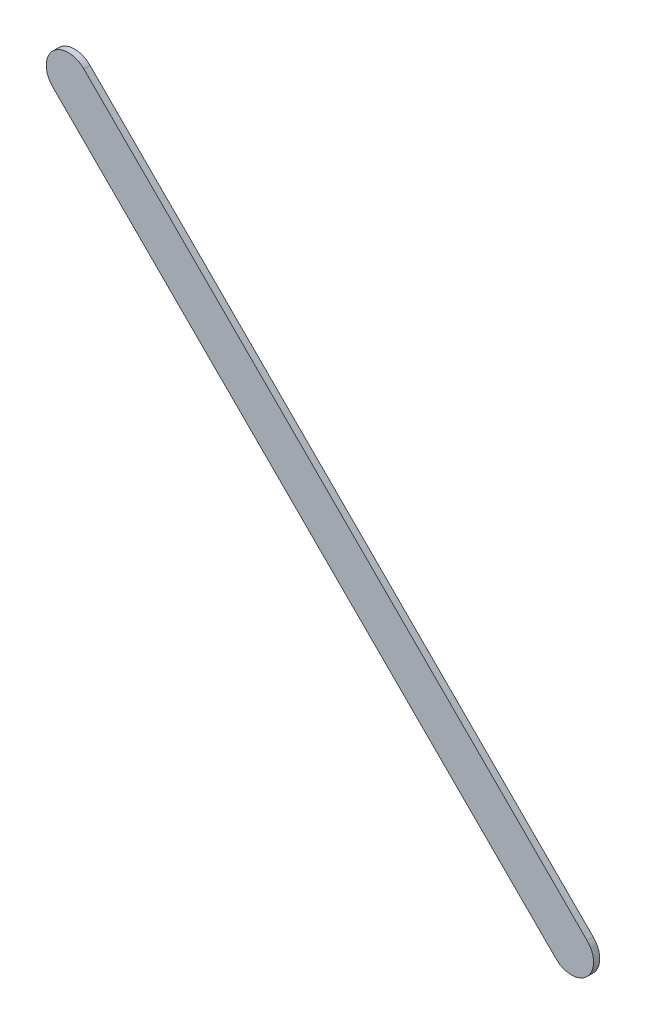
ISO-10303-21;
HEADER;
FILE_DESCRIPTION(('STEP AP214'),'2;1');
FILE_NAME('part.step','',(''),(''),'','','');
FILE_SCHEMA(('AUTOMOTIVE_DESIGN { 1 0 10303 214 1 1 1 1 }'));
ENDSEC;
DATA;
#1=APPLICATION_CONTEXT('core data for automotive mechanical design processes');
#2=APPLICATION_PROTOCOL_DEFINITION('international standard','automotive_design',2000,#1);
#3=PRODUCT_CONTEXT('',#1,'mechanical');
#4=PRODUCT('Part','Part','',(#3));
#5=PRODUCT_RELATED_PRODUCT_CATEGORY('part','',(#4));
#6=PRODUCT_DEFINITION_FORMATION('','',#4);
#7=PRODUCT_DEFINITION_CONTEXT('part definition',#1,'design');
#8=PRODUCT_DEFINITION('design','',#6,#7);
#9=PRODUCT_DEFINITION_SHAPE('','',#8);
#10=(LENGTH_UNIT() NAMED_UNIT(*) SI_UNIT(.MILLI.,.METRE.));
#11=(NAMED_UNIT(*) PLANE_ANGLE_UNIT() SI_UNIT($,.RADIAN.));
#12=(NAMED_UNIT(*) SI_UNIT($,.STERADIAN.) SOLID_ANGLE_UNIT());
#13=UNCERTAINTY_MEASURE_WITH_UNIT(LENGTH_MEASURE(1.E-05),#10,'distance_accuracy_value','');
#14=(GEOMETRIC_REPRESENTATION_CONTEXT(3) GLOBAL_UNCERTAINTY_ASSIGNED_CONTEXT((#13)) GLOBAL_UNIT_ASSIGNED_CONTEXT((#10,
#11,#12)) REPRESENTATION_CONTEXT('',''));
#15=CARTESIAN_POINT('',(0.,0.,0.));
#16=DIRECTION('',(0.,0.,1.));
#17=DIRECTION('',(1.,0.,0.));
#18=AXIS2_PLACEMENT_3D('',#15,#16,#17);
#19=CARTESIAN_POINT('',(87.2272195,97.59712256,0.));
#20=DIRECTION('',(0.707106781186548,0.707106781186548,0.));
#21=DIRECTION('',(0.707106781186548,-0.707106781186548,0.));
#22=AXIS2_PLACEMENT_3D('',#19,#20,#21);
#23=PLANE('',#22);
#24=DIRECTION('',(0.707106781186548,-0.707106781186548,0.));
#25=VECTOR('',#24,1.);
#26=CARTESIAN_POINT('',(87.2272195,97.59712256,0.03556));
#27=LINE('',#26,#25);
#28=CARTESIAN_POINT('',(87.2272195,97.59712256,0.03556));
#29=VERTEX_POINT('',#28);
#30=CARTESIAN_POINT('',(90.12717052,94.69717154,0.03556));
#31=VERTEX_POINT('',#30);
#32=EDGE_CURVE('E11',#29,#31,#27,.T.);
#33=ORIENTED_EDGE('',*,*,#32,.F.);
#34=DIRECTION('',(0.,0.,1.));
#35=VECTOR('',#34,1.);
#36=CARTESIAN_POINT('',(87.2272195,97.59712256,0.));
#37=LINE('',#36,#35);
#38=CARTESIAN_POINT('',(87.2272195,97.59712256,0.));
#39=VERTEX_POINT('',#38);
#40=EDGE_CURVE('E24',#39,#29,#37,.T.);
#41=ORIENTED_EDGE('',*,*,#40,.F.);
#42=DIRECTION('',(0.707106781186548,-0.707106781186548,0.));
#43=VECTOR('',#42,1.);
#44=CARTESIAN_POINT('',(87.2272195,97.59712256,0.));
#45=LINE('',#44,#43);
#46=CARTESIAN_POINT('',(90.12717052,94.69717154,0.));
#47=VERTEX_POINT('',#46);
#48=EDGE_CURVE('E75',#39,#47,#45,.T.);
#49=ORIENTED_EDGE('',*,*,#48,.T.);
#50=DIRECTION('',(0.,0.,1.));
#51=VECTOR('',#50,1.);
#52=CARTESIAN_POINT('',(90.12717052,94.69717154,0.));
#53=LINE('',#52,#51);
#54=EDGE_CURVE('E37',#47,#31,#53,.T.);
#55=ORIENTED_EDGE('',*,*,#54,.T.);
#56=EDGE_LOOP('',(#33,#41,#49,#55));
#57=FACE_BOUND('',#56,.T.);
#58=ADVANCED_FACE('F17',(#57),#23,.F.);
#59=CARTESIAN_POINT('',(90.21697349,94.78697451,0.));
#60=DIRECTION('',(0.,0.,-1.));
#61=DIRECTION('',(-0.707106781186548,-0.707106781186548,0.));
#62=AXIS2_PLACEMENT_3D('',#59,#60,#61);
#63=CYLINDRICAL_SURFACE('',#62,0.127000578115386);
#64=CARTESIAN_POINT('',(90.21697349,94.78697451,0.03556));
#65=DIRECTION('',(0.,0.,1.));
#66=DIRECTION('',(-0.707106781186548,-0.707106781186548,0.));
#67=AXIS2_PLACEMENT_3D('',#64,#65,#66);
#68=CIRCLE('',#67,0.127000578115386);
#69=CARTESIAN_POINT('',(90.30677646,94.87677748,0.03556));
#70=VERTEX_POINT('',#69);
#71=EDGE_CURVE('E83',#31,#70,#68,.T.);
#72=ORIENTED_EDGE('',*,*,#71,.F.);
#73=ORIENTED_EDGE('',*,*,#54,.F.);
#74=CARTESIAN_POINT('',(90.21697349,94.78697451,0.));
#75=DIRECTION('',(0.,0.,1.));
#76=DIRECTION('',(-0.707106781186548,-0.707106781186548,0.));
#77=AXIS2_PLACEMENT_3D('',#74,#75,#76);
#78=CIRCLE('',#77,0.127000578115386);
#79=CARTESIAN_POINT('',(90.30677646,94.87677748,0.));
#80=VERTEX_POINT('',#79);
#81=EDGE_CURVE('E81',#47,#80,#78,.T.);
#82=ORIENTED_EDGE('',*,*,#81,.T.);
#83=DIRECTION('',(0.,0.,1.));
#84=VECTOR('',#83,1.);
#85=CARTESIAN_POINT('',(90.30677646,94.87677748,0.));
#86=LINE('',#85,#84);
#87=EDGE_CURVE('E67',#80,#70,#86,.T.);
#88=ORIENTED_EDGE('',*,*,#87,.T.);
#89=EDGE_LOOP('',(#72,#73,#82,#88));
#90=FACE_BOUND('',#89,.T.);
#91=ADVANCED_FACE('F89',(#90),#63,.T.);
#92=CARTESIAN_POINT('',(90.30677646,94.87677748,0.));
#93=DIRECTION('',(-0.707106781186546,-0.707106781186549,0.));
#94=DIRECTION('',(-0.707106781186549,0.707106781186546,0.));
#95=AXIS2_PLACEMENT_3D('',#92,#93,#94);
#96=PLANE('',#95);
#97=DIRECTION('',(-0.707106781186549,0.707106781186546,0.));
#98=VECTOR('',#97,1.);
#99=CARTESIAN_POINT('',(90.30677646,94.87677748,0.03556));
#100=LINE('',#99,#98);
#101=CARTESIAN_POINT('',(87.40682544,97.7767285,0.03556));
#102=VERTEX_POINT('',#101);
#103=EDGE_CURVE('E71',#70,#102,#100,.T.);
#104=ORIENTED_EDGE('',*,*,#103,.F.);
#105=ORIENTED_EDGE('',*,*,#87,.F.);
#106=DIRECTION('',(-0.707106781186549,0.707106781186546,0.));
#107=VECTOR('',#106,1.);
#108=CARTESIAN_POINT('',(90.30677646,94.87677748,0.));
#109=LINE('',#108,#107);
#110=CARTESIAN_POINT('',(87.40682544,97.7767285,0.));
#111=VERTEX_POINT('',#110);
#112=EDGE_CURVE('E63',#80,#111,#109,.T.);
#113=ORIENTED_EDGE('',*,*,#112,.T.);
#114=DIRECTION('',(0.,0.,1.));
#115=VECTOR('',#114,1.);
#116=CARTESIAN_POINT('',(87.40682544,97.7767285,0.));
#117=LINE('',#116,#115);
#118=EDGE_CURVE('E53',#111,#102,#117,.T.);
#119=ORIENTED_EDGE('',*,*,#118,.T.);
#120=EDGE_LOOP('',(#104,#105,#113,#119));
#121=FACE_BOUND('',#120,.T.);
#122=ADVANCED_FACE('F66',(#121),#96,.F.);
#123=CARTESIAN_POINT('',(87.31702247,97.68692553,0.));
#124=DIRECTION('',(0.,0.,-1.));
#125=DIRECTION('',(0.707106781186604,0.707106781186492,0.));
#126=AXIS2_PLACEMENT_3D('',#123,#124,#125);
#127=CYLINDRICAL_SURFACE('',#126,0.127000578115379);
#128=CARTESIAN_POINT('',(87.31702247,97.68692553,0.03556));
#129=DIRECTION('',(0.,0.,1.));
#130=DIRECTION('',(0.707106781186604,0.707106781186492,0.));
#131=AXIS2_PLACEMENT_3D('',#128,#129,#130);
#132=CIRCLE('',#131,0.127000578115379);
#133=EDGE_CURVE('E59',#102,#29,#132,.T.);
#134=ORIENTED_EDGE('',*,*,#133,.F.);
#135=ORIENTED_EDGE('',*,*,#118,.F.);
#136=CARTESIAN_POINT('',(87.31702247,97.68692553,0.));
#137=DIRECTION('',(0.,0.,1.));
#138=DIRECTION('',(0.707106781186604,0.707106781186492,0.));
#139=AXIS2_PLACEMENT_3D('',#136,#137,#138);
#140=CIRCLE('',#139,0.127000578115379);
#141=EDGE_CURVE('E57',#111,#39,#140,.T.);
#142=ORIENTED_EDGE('',*,*,#141,.T.);
#143=ORIENTED_EDGE('',*,*,#40,.T.);
#144=EDGE_LOOP('',(#134,#135,#142,#143));
#145=FACE_BOUND('',#144,.T.);
#146=ADVANCED_FACE('F55',(#145),#127,.T.);
#147=CARTESIAN_POINT('',(87.2272195,97.59712256,0.));
#148=DIRECTION('',(0.,0.,-1.));
#149=DIRECTION('',(-1.,0.,0.));
#150=AXIS2_PLACEMENT_3D('',#147,#148,#149);
#151=PLANE('',#150);
#152=ORIENTED_EDGE('',*,*,#141,.F.);
#153=ORIENTED_EDGE('',*,*,#112,.F.);
#154=ORIENTED_EDGE('',*,*,#81,.F.);
#155=ORIENTED_EDGE('',*,*,#48,.F.);
#156=EDGE_LOOP('',(#152,#153,#154,#155));
#157=FACE_BOUND('',#156,.T.);
#158=ADVANCED_FACE('F74',(#157),#151,.T.);
#159=CARTESIAN_POINT('',(87.2272195,97.59712256,0.03556));
#160=DIRECTION('',(0.,0.,-1.));
#161=DIRECTION('',(-1.,0.,0.));
#162=AXIS2_PLACEMENT_3D('',#159,#160,#161);
#163=PLANE('',#162);
#164=ORIENTED_EDGE('',*,*,#32,.T.);
#165=ORIENTED_EDGE('',*,*,#71,.T.);
#166=ORIENTED_EDGE('',*,*,#103,.T.);
#167=ORIENTED_EDGE('',*,*,#133,.T.);
#168=EDGE_LOOP('',(#164,#165,#166,#167));
#169=FACE_BOUND('',#168,.T.);
#170=ADVANCED_FACE('F91',(#169),#163,.F.);
#171=CLOSED_SHELL('',(#58,#91,#122,#146,#158,#170));
#172=MANIFOLD_SOLID_BREP('B1',#171);
#173=ADVANCED_BREP_SHAPE_REPRESENTATION('',(#18,#172),#14);
#174=SHAPE_DEFINITION_REPRESENTATION(#9,#173);
ENDSEC;
END-ISO-10303-21;
